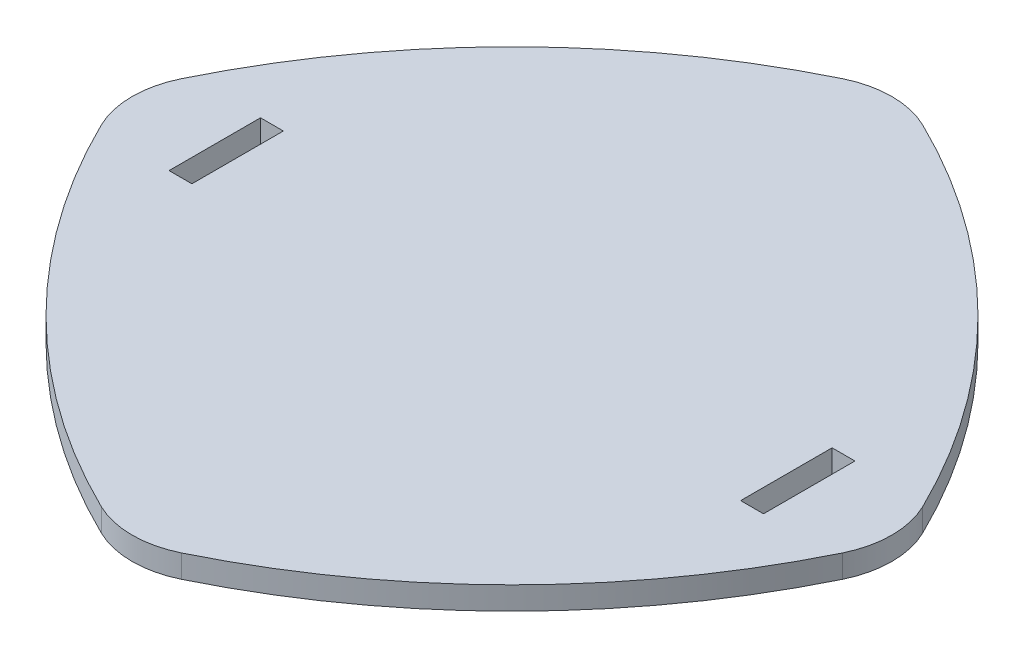
ISO-10303-21;
HEADER;
FILE_DESCRIPTION(('STEP AP214'),'2;1');
FILE_NAME('part.step','',(''),(''),'','','');
FILE_SCHEMA(('AUTOMOTIVE_DESIGN { 1 0 10303 214 1 1 1 1 }'));
ENDSEC;
DATA;
#1=APPLICATION_CONTEXT('core data for automotive mechanical design processes');
#2=APPLICATION_PROTOCOL_DEFINITION('international standard','automotive_design',2000,#1);
#3=PRODUCT_CONTEXT('',#1,'mechanical');
#4=PRODUCT('Part','Part','',(#3));
#5=PRODUCT_RELATED_PRODUCT_CATEGORY('part','',(#4));
#6=PRODUCT_DEFINITION_FORMATION('','',#4);
#7=PRODUCT_DEFINITION_CONTEXT('part definition',#1,'design');
#8=PRODUCT_DEFINITION('design','',#6,#7);
#9=PRODUCT_DEFINITION_SHAPE('','',#8);
#10=(LENGTH_UNIT() NAMED_UNIT(*) SI_UNIT(.MILLI.,.METRE.));
#11=(NAMED_UNIT(*) PLANE_ANGLE_UNIT() SI_UNIT($,.RADIAN.));
#12=(NAMED_UNIT(*) SI_UNIT($,.STERADIAN.) SOLID_ANGLE_UNIT());
#13=UNCERTAINTY_MEASURE_WITH_UNIT(LENGTH_MEASURE(1.E-05),#10,'distance_accuracy_value','');
#14=(GEOMETRIC_REPRESENTATION_CONTEXT(3) GLOBAL_UNCERTAINTY_ASSIGNED_CONTEXT((#13)) GLOBAL_UNIT_ASSIGNED_CONTEXT((#10,
#11,#12)) REPRESENTATION_CONTEXT('',''));
#15=CARTESIAN_POINT('',(0.,0.,0.));
#16=DIRECTION('',(0.,0.,1.));
#17=DIRECTION('',(1.,0.,0.));
#18=AXIS2_PLACEMENT_3D('',#15,#16,#17);
#19=CARTESIAN_POINT('',(6.01040764008565,0.25,-6.01040764008566));
#20=DIRECTION('',(0.,-1.,0.));
#21=DIRECTION('',(0.,0.,-1.));
#22=AXIS2_PLACEMENT_3D('',#19,#20,#21);
#23=CYLINDRICAL_SURFACE('',#22,15.7059520526919);
#24=CARTESIAN_POINT('',(6.01040764008565,0.25,-6.01040764008566));
#25=DIRECTION('',(0.,1.,0.));
#26=DIRECTION('',(0.,0.,-1.));
#27=AXIS2_PLACEMENT_3D('',#24,#25,#26);
#28=CIRCLE('',#27,15.7059520526919);
#29=CARTESIAN_POINT('',(-8.10482693305001,0.25,0.877050731970893));
#30=VERTEX_POINT('',#29);
#31=CARTESIAN_POINT('',(-0.877050731970878,0.25,8.10482693305001));
#32=VERTEX_POINT('',#31);
#33=EDGE_CURVE('E213',#30,#32,#28,.T.);
#34=ORIENTED_EDGE('',*,*,#33,.F.);
#35=DIRECTION('',(0.,-1.,0.));
#36=VECTOR('',#35,1.);
#37=CARTESIAN_POINT('',(-8.10482693305001,0.25,0.877050731970892));
#38=LINE('',#37,#36);
#39=CARTESIAN_POINT('',(-8.10482693305001,-0.25,0.877050731970893));
#40=VERTEX_POINT('',#39);
#41=EDGE_CURVE('E238',#30,#40,#38,.T.);
#42=ORIENTED_EDGE('',*,*,#41,.T.);
#43=CARTESIAN_POINT('',(6.01040764008565,-0.25,-6.01040764008566));
#44=DIRECTION('',(0.,1.,0.));
#45=DIRECTION('',(0.,0.,-1.));
#46=AXIS2_PLACEMENT_3D('',#43,#44,#45);
#47=CIRCLE('',#46,15.7059520526919);
#48=CARTESIAN_POINT('',(-0.877050731970878,-0.25,8.10482693305001));
#49=VERTEX_POINT('',#48);
#50=EDGE_CURVE('E212',#40,#49,#47,.T.);
#51=ORIENTED_EDGE('',*,*,#50,.T.);
#52=DIRECTION('',(0.,-1.,0.));
#53=VECTOR('',#52,1.);
#54=CARTESIAN_POINT('',(-0.877050731970878,0.25,8.10482693305001));
#55=LINE('',#54,#53);
#56=EDGE_CURVE('E226',#49,#32,#55,.F.);
#57=ORIENTED_EDGE('',*,*,#56,.T.);
#58=EDGE_LOOP('',(#34,#42,#51,#57));
#59=FACE_BOUND('',#58,.T.);
#60=ADVANCED_FACE('F34',(#59),#23,.T.);
#61=CARTESIAN_POINT('',(-6.01040764008566,0.25,-6.01040764008565));
#62=DIRECTION('',(0.,-1.,0.));
#63=DIRECTION('',(0.,0.,-1.));
#64=AXIS2_PLACEMENT_3D('',#61,#62,#63);
#65=CYLINDRICAL_SURFACE('',#64,15.7059520526919);
#66=CARTESIAN_POINT('',(-6.01040764008566,-0.25,-6.01040764008565));
#67=DIRECTION('',(0.,1.,0.));
#68=DIRECTION('',(0.,0.,-1.));
#69=AXIS2_PLACEMENT_3D('',#66,#67,#68);
#70=CIRCLE('',#69,15.7059520526919);
#71=CARTESIAN_POINT('',(0.877050731970899,-0.25,8.10482693305001));
#72=VERTEX_POINT('',#71);
#73=CARTESIAN_POINT('',(8.10482693305002,-0.25,0.877050731970885));
#74=VERTEX_POINT('',#73);
#75=EDGE_CURVE('E229',#72,#74,#70,.T.);
#76=ORIENTED_EDGE('',*,*,#75,.T.);
#77=DIRECTION('',(0.,-1.,0.));
#78=VECTOR('',#77,1.);
#79=CARTESIAN_POINT('',(8.10482693305002,0.25,0.877050731970885));
#80=LINE('',#79,#78);
#81=CARTESIAN_POINT('',(8.10482693305002,0.25,0.877050731970885));
#82=VERTEX_POINT('',#81);
#83=EDGE_CURVE('E11',#74,#82,#80,.F.);
#84=ORIENTED_EDGE('',*,*,#83,.T.);
#85=CARTESIAN_POINT('',(-6.01040764008566,0.25,-6.01040764008565));
#86=DIRECTION('',(0.,1.,0.));
#87=DIRECTION('',(0.,0.,-1.));
#88=AXIS2_PLACEMENT_3D('',#85,#86,#87);
#89=CIRCLE('',#88,15.7059520526919);
#90=CARTESIAN_POINT('',(0.877050731970899,0.25,8.10482693305001));
#91=VERTEX_POINT('',#90);
#92=EDGE_CURVE('E216',#91,#82,#89,.T.);
#93=ORIENTED_EDGE('',*,*,#92,.F.);
#94=DIRECTION('',(0.,-1.,0.));
#95=VECTOR('',#94,1.);
#96=CARTESIAN_POINT('',(0.8770507319709,0.25,8.10482693305001));
#97=LINE('',#96,#95);
#98=EDGE_CURVE('E42',#91,#72,#97,.T.);
#99=ORIENTED_EDGE('',*,*,#98,.T.);
#100=EDGE_LOOP('',(#76,#84,#93,#99));
#101=FACE_BOUND('',#100,.T.);
#102=ADVANCED_FACE('F271',(#101),#65,.T.);
#103=CARTESIAN_POINT('',(-6.01040764008565,0.25,6.01040764008566));
#104=DIRECTION('',(0.,-1.,0.));
#105=DIRECTION('',(0.,0.,-1.));
#106=AXIS2_PLACEMENT_3D('',#103,#104,#105);
#107=CYLINDRICAL_SURFACE('',#106,15.7059520526919);
#108=CARTESIAN_POINT('',(-6.01040764008565,-0.25,6.01040764008566));
#109=DIRECTION('',(0.,1.,0.));
#110=DIRECTION('',(0.,0.,-1.));
#111=AXIS2_PLACEMENT_3D('',#108,#109,#110);
#112=CIRCLE('',#111,15.7059520526919);
#113=CARTESIAN_POINT('',(8.10482693305001,-0.25,-0.877050731970892));
#114=VERTEX_POINT('',#113);
#115=CARTESIAN_POINT('',(0.877050731970889,-0.25,-8.10482693305001));
#116=VERTEX_POINT('',#115);
#117=EDGE_CURVE('E232',#114,#116,#112,.T.);
#118=ORIENTED_EDGE('',*,*,#117,.T.);
#119=DIRECTION('',(0.,-1.,0.));
#120=VECTOR('',#119,1.);
#121=CARTESIAN_POINT('',(0.877050731970891,0.25,-8.10482693305001));
#122=LINE('',#121,#120);
#123=CARTESIAN_POINT('',(0.877050731970889,0.25,-8.10482693305001));
#124=VERTEX_POINT('',#123);
#125=EDGE_CURVE('E265',#116,#124,#122,.F.);
#126=ORIENTED_EDGE('',*,*,#125,.T.);
#127=CARTESIAN_POINT('',(-6.01040764008565,0.25,6.01040764008566));
#128=DIRECTION('',(0.,1.,0.));
#129=DIRECTION('',(0.,0.,-1.));
#130=AXIS2_PLACEMENT_3D('',#127,#128,#129);
#131=CIRCLE('',#130,15.7059520526919);
#132=CARTESIAN_POINT('',(8.10482693305001,0.25,-0.877050731970892));
#133=VERTEX_POINT('',#132);
#134=EDGE_CURVE('E220',#133,#124,#131,.T.);
#135=ORIENTED_EDGE('',*,*,#134,.F.);
#136=DIRECTION('',(0.,-1.,0.));
#137=VECTOR('',#136,1.);
#138=CARTESIAN_POINT('',(8.10482693305001,0.25,-0.877050731970891));
#139=LINE('',#138,#137);
#140=EDGE_CURVE('E262',#133,#114,#139,.T.);
#141=ORIENTED_EDGE('',*,*,#140,.T.);
#142=EDGE_LOOP('',(#118,#126,#135,#141));
#143=FACE_BOUND('',#142,.T.);
#144=ADVANCED_FACE('F284',(#143),#107,.T.);
#145=CARTESIAN_POINT('',(6.01040764008566,0.25,6.01040764008565));
#146=DIRECTION('',(0.,-1.,0.));
#147=DIRECTION('',(0.,0.,-1.));
#148=AXIS2_PLACEMENT_3D('',#145,#146,#147);
#149=CYLINDRICAL_SURFACE('',#148,15.7059520526919);
#150=CARTESIAN_POINT('',(6.01040764008566,-0.25,6.01040764008565));
#151=DIRECTION('',(0.,1.,0.));
#152=DIRECTION('',(0.,0.,-1.));
#153=AXIS2_PLACEMENT_3D('',#150,#151,#152);
#154=CIRCLE('',#153,15.7059520526919);
#155=CARTESIAN_POINT('',(-0.877050731970888,-0.25,-8.10482693305001));
#156=VERTEX_POINT('',#155);
#157=CARTESIAN_POINT('',(-8.10482693305001,-0.25,-0.877050731970884));
#158=VERTEX_POINT('',#157);
#159=EDGE_CURVE('E217',#156,#158,#154,.T.);
#160=ORIENTED_EDGE('',*,*,#159,.T.);
#161=DIRECTION('',(0.,-1.,0.));
#162=VECTOR('',#161,1.);
#163=CARTESIAN_POINT('',(-8.10482693305001,0.25,-0.877050731970884));
#164=LINE('',#163,#162);
#165=CARTESIAN_POINT('',(-8.10482693305001,0.25,-0.877050731970884));
#166=VERTEX_POINT('',#165);
#167=EDGE_CURVE('E252',#158,#166,#164,.F.);
#168=ORIENTED_EDGE('',*,*,#167,.T.);
#169=CARTESIAN_POINT('',(6.01040764008566,0.25,6.01040764008565));
#170=DIRECTION('',(0.,1.,0.));
#171=DIRECTION('',(0.,0.,-1.));
#172=AXIS2_PLACEMENT_3D('',#169,#170,#171);
#173=CIRCLE('',#172,15.7059520526919);
#174=CARTESIAN_POINT('',(-0.877050731970888,0.25,-8.10482693305001));
#175=VERTEX_POINT('',#174);
#176=EDGE_CURVE('E223',#175,#166,#173,.T.);
#177=ORIENTED_EDGE('',*,*,#176,.F.);
#178=DIRECTION('',(0.,-1.,0.));
#179=VECTOR('',#178,1.);
#180=CARTESIAN_POINT('',(-0.877050731970888,0.25,-8.10482693305001));
#181=LINE('',#180,#179);
#182=EDGE_CURVE('E249',#175,#156,#181,.T.);
#183=ORIENTED_EDGE('',*,*,#182,.T.);
#184=EDGE_LOOP('',(#160,#168,#177,#183));
#185=FACE_BOUND('',#184,.T.);
#186=ADVANCED_FACE('F295',(#185),#149,.T.);
#187=CARTESIAN_POINT('',(6.01040764008566,0.25,0.));
#188=DIRECTION('',(0.,-1.,0.));
#189=DIRECTION('',(0.,0.,-1.));
#190=AXIS2_PLACEMENT_3D('',#187,#188,#189);
#191=PLANE('',#190);
#192=DIRECTION('',(-1.,0.,0.));
#193=VECTOR('',#192,1.);
#194=CARTESIAN_POINT('',(6.,0.25,-1.));
#195=LINE('',#194,#193);
#196=CARTESIAN_POINT('',(6.5,0.25,-1.));
#197=VERTEX_POINT('',#196);
#198=CARTESIAN_POINT('',(6.,0.25,-1.));
#199=VERTEX_POINT('',#198);
#200=EDGE_CURVE('E165',#197,#199,#195,.T.);
#201=ORIENTED_EDGE('',*,*,#200,.F.);
#202=DIRECTION('',(0.,0.,-1.));
#203=VECTOR('',#202,1.);
#204=CARTESIAN_POINT('',(6.5,0.25,1.));
#205=LINE('',#204,#203);
#206=CARTESIAN_POINT('',(6.5,0.25,1.));
#207=VERTEX_POINT('',#206);
#208=EDGE_CURVE('E49',#207,#197,#205,.T.);
#209=ORIENTED_EDGE('',*,*,#208,.F.);
#210=DIRECTION('',(1.,0.,0.));
#211=VECTOR('',#210,1.);
#212=CARTESIAN_POINT('',(6.,0.25,1.));
#213=LINE('',#212,#211);
#214=CARTESIAN_POINT('',(6.,0.25,1.));
#215=VERTEX_POINT('',#214);
#216=EDGE_CURVE('E158',#215,#207,#213,.T.);
#217=ORIENTED_EDGE('',*,*,#216,.F.);
#218=DIRECTION('',(0.,0.,1.));
#219=VECTOR('',#218,1.);
#220=CARTESIAN_POINT('',(6.,0.25,1.));
#221=LINE('',#220,#219);
#222=EDGE_CURVE('E172',#199,#215,#221,.T.);
#223=ORIENTED_EDGE('',*,*,#222,.F.);
#224=EDGE_LOOP('',(#201,#209,#217,#223));
#225=FACE_BOUND('',#224,.T.);
#226=DIRECTION('',(-1.,0.,0.));
#227=VECTOR('',#226,1.);
#228=CARTESIAN_POINT('',(-6.5,0.25,-1.));
#229=LINE('',#228,#227);
#230=CARTESIAN_POINT('',(-6.,0.25,-1.));
#231=VERTEX_POINT('',#230);
#232=CARTESIAN_POINT('',(-6.5,0.25,-1.));
#233=VERTEX_POINT('',#232);
#234=EDGE_CURVE('E191',#231,#233,#229,.T.);
#235=ORIENTED_EDGE('',*,*,#234,.F.);
#236=DIRECTION('',(0.,0.,-1.));
#237=VECTOR('',#236,1.);
#238=CARTESIAN_POINT('',(-6.,0.25,1.));
#239=LINE('',#238,#237);
#240=CARTESIAN_POINT('',(-6.,0.25,1.));
#241=VERTEX_POINT('',#240);
#242=EDGE_CURVE('E189',#241,#231,#239,.T.);
#243=ORIENTED_EDGE('',*,*,#242,.F.);
#244=DIRECTION('',(1.,0.,0.));
#245=VECTOR('',#244,1.);
#246=CARTESIAN_POINT('',(-6.5,0.25,1.));
#247=LINE('',#246,#245);
#248=CARTESIAN_POINT('',(-6.5,0.25,1.));
#249=VERTEX_POINT('',#248);
#250=EDGE_CURVE('E197',#249,#241,#247,.T.);
#251=ORIENTED_EDGE('',*,*,#250,.F.);
#252=DIRECTION('',(0.,0.,1.));
#253=VECTOR('',#252,1.);
#254=CARTESIAN_POINT('',(-6.5,0.25,1.));
#255=LINE('',#254,#253);
#256=EDGE_CURVE('E194',#233,#249,#255,.T.);
#257=ORIENTED_EDGE('',*,*,#256,.F.);
#258=EDGE_LOOP('',(#235,#243,#251,#257));
#259=FACE_BOUND('',#258,.T.);
#260=ORIENTED_EDGE('',*,*,#176,.T.);
#261=CARTESIAN_POINT('',(-6.30738930866653,0.25,0.));
#262=DIRECTION('',(0.,-1.,0.));
#263=DIRECTION('',(0.,0.,-1.));
#264=AXIS2_PLACEMENT_3D('',#261,#262,#263);
#265=CIRCLE('',#264,2.);
#266=EDGE_CURVE('E260',#166,#30,#265,.F.);
#267=ORIENTED_EDGE('',*,*,#266,.T.);
#268=ORIENTED_EDGE('',*,*,#33,.T.);
#269=CARTESIAN_POINT('',(0.,0.25,6.30738930866653));
#270=DIRECTION('',(0.,-1.,0.));
#271=DIRECTION('',(0.,0.,-1.));
#272=AXIS2_PLACEMENT_3D('',#269,#270,#271);
#273=CIRCLE('',#272,2.);
#274=EDGE_CURVE('E254',#32,#91,#273,.F.);
#275=ORIENTED_EDGE('',*,*,#274,.T.);
#276=ORIENTED_EDGE('',*,*,#92,.T.);
#277=CARTESIAN_POINT('',(6.30738930866653,0.25,0.));
#278=DIRECTION('',(0.,-1.,0.));
#279=DIRECTION('',(0.,0.,-1.));
#280=AXIS2_PLACEMENT_3D('',#277,#278,#279);
#281=CIRCLE('',#280,2.);
#282=EDGE_CURVE('E256',#82,#133,#281,.F.);
#283=ORIENTED_EDGE('',*,*,#282,.T.);
#284=ORIENTED_EDGE('',*,*,#134,.T.);
#285=CARTESIAN_POINT('',(0.,0.25,-6.30738930866653));
#286=DIRECTION('',(0.,-1.,0.));
#287=DIRECTION('',(0.,0.,-1.));
#288=AXIS2_PLACEMENT_3D('',#285,#286,#287);
#289=CIRCLE('',#288,2.);
#290=EDGE_CURVE('E258',#124,#175,#289,.F.);
#291=ORIENTED_EDGE('',*,*,#290,.T.);
#292=EDGE_LOOP('',(#260,#267,#268,#275,#276,#283,#284,#291));
#293=FACE_BOUND('',#292,.T.);
#294=ADVANCED_FACE('F288',(#225,#259,#293),#191,.F.);
#295=CARTESIAN_POINT('',(6.01040764008566,-0.25,0.));
#296=DIRECTION('',(0.,-1.,0.));
#297=DIRECTION('',(0.,0.,-1.));
#298=AXIS2_PLACEMENT_3D('',#295,#296,#297);
#299=PLANE('',#298);
#300=DIRECTION('',(0.,0.,-1.));
#301=VECTOR('',#300,1.);
#302=CARTESIAN_POINT('',(6.5,-0.25,1.));
#303=LINE('',#302,#301);
#304=CARTESIAN_POINT('',(6.5,-0.25,1.));
#305=VERTEX_POINT('',#304);
#306=CARTESIAN_POINT('',(6.5,-0.25,-1.));
#307=VERTEX_POINT('',#306);
#308=EDGE_CURVE('E156',#305,#307,#303,.T.);
#309=ORIENTED_EDGE('',*,*,#308,.T.);
#310=DIRECTION('',(-1.,0.,0.));
#311=VECTOR('',#310,1.);
#312=CARTESIAN_POINT('',(6.,-0.25,-1.));
#313=LINE('',#312,#311);
#314=CARTESIAN_POINT('',(6.,-0.25,-1.));
#315=VERTEX_POINT('',#314);
#316=EDGE_CURVE('E145',#307,#315,#313,.T.);
#317=ORIENTED_EDGE('',*,*,#316,.T.);
#318=DIRECTION('',(0.,0.,1.));
#319=VECTOR('',#318,1.);
#320=CARTESIAN_POINT('',(6.,-0.25,1.));
#321=LINE('',#320,#319);
#322=CARTESIAN_POINT('',(6.,-0.25,1.));
#323=VERTEX_POINT('',#322);
#324=EDGE_CURVE('E167',#315,#323,#321,.T.);
#325=ORIENTED_EDGE('',*,*,#324,.T.);
#326=DIRECTION('',(1.,0.,0.));
#327=VECTOR('',#326,1.);
#328=CARTESIAN_POINT('',(6.,-0.25,1.));
#329=LINE('',#328,#327);
#330=EDGE_CURVE('E163',#323,#305,#329,.T.);
#331=ORIENTED_EDGE('',*,*,#330,.T.);
#332=EDGE_LOOP('',(#309,#317,#325,#331));
#333=FACE_BOUND('',#332,.T.);
#334=DIRECTION('',(0.,0.,-1.));
#335=VECTOR('',#334,1.);
#336=CARTESIAN_POINT('',(-6.,-0.25,1.));
#337=LINE('',#336,#335);
#338=CARTESIAN_POINT('',(-6.,-0.25,1.));
#339=VERTEX_POINT('',#338);
#340=CARTESIAN_POINT('',(-6.,-0.25,-1.));
#341=VERTEX_POINT('',#340);
#342=EDGE_CURVE('E186',#339,#341,#337,.T.);
#343=ORIENTED_EDGE('',*,*,#342,.T.);
#344=DIRECTION('',(-1.,0.,0.));
#345=VECTOR('',#344,1.);
#346=CARTESIAN_POINT('',(-6.5,-0.25,-1.));
#347=LINE('',#346,#345);
#348=CARTESIAN_POINT('',(-6.5,-0.25,-1.));
#349=VERTEX_POINT('',#348);
#350=EDGE_CURVE('E203',#341,#349,#347,.T.);
#351=ORIENTED_EDGE('',*,*,#350,.T.);
#352=DIRECTION('',(0.,0.,1.));
#353=VECTOR('',#352,1.);
#354=CARTESIAN_POINT('',(-6.5,-0.25,1.));
#355=LINE('',#354,#353);
#356=CARTESIAN_POINT('',(-6.5,-0.25,1.));
#357=VERTEX_POINT('',#356);
#358=EDGE_CURVE('E152',#349,#357,#355,.T.);
#359=ORIENTED_EDGE('',*,*,#358,.T.);
#360=DIRECTION('',(1.,0.,0.));
#361=VECTOR('',#360,1.);
#362=CARTESIAN_POINT('',(-6.5,-0.25,1.));
#363=LINE('',#362,#361);
#364=EDGE_CURVE('E183',#357,#339,#363,.T.);
#365=ORIENTED_EDGE('',*,*,#364,.T.);
#366=EDGE_LOOP('',(#343,#351,#359,#365));
#367=FACE_BOUND('',#366,.T.);
#368=ORIENTED_EDGE('',*,*,#50,.F.);
#369=CARTESIAN_POINT('',(-6.30738930866653,-0.25,0.));
#370=DIRECTION('',(0.,-1.,0.));
#371=DIRECTION('',(0.,0.,-1.));
#372=AXIS2_PLACEMENT_3D('',#369,#370,#371);
#373=CIRCLE('',#372,2.);
#374=EDGE_CURVE('E247',#40,#158,#373,.T.);
#375=ORIENTED_EDGE('',*,*,#374,.T.);
#376=ORIENTED_EDGE('',*,*,#159,.F.);
#377=CARTESIAN_POINT('',(0.,-0.25,-6.30738930866653));
#378=DIRECTION('',(0.,-1.,0.));
#379=DIRECTION('',(0.,0.,-1.));
#380=AXIS2_PLACEMENT_3D('',#377,#378,#379);
#381=CIRCLE('',#380,2.);
#382=EDGE_CURVE('E245',#156,#116,#381,.T.);
#383=ORIENTED_EDGE('',*,*,#382,.T.);
#384=ORIENTED_EDGE('',*,*,#117,.F.);
#385=CARTESIAN_POINT('',(6.30738930866653,-0.25,0.));
#386=DIRECTION('',(0.,-1.,0.));
#387=DIRECTION('',(0.,0.,-1.));
#388=AXIS2_PLACEMENT_3D('',#385,#386,#387);
#389=CIRCLE('',#388,2.);
#390=EDGE_CURVE('E243',#114,#74,#389,.T.);
#391=ORIENTED_EDGE('',*,*,#390,.T.);
#392=ORIENTED_EDGE('',*,*,#75,.F.);
#393=CARTESIAN_POINT('',(0.,-0.25,6.30738930866653));
#394=DIRECTION('',(0.,-1.,0.));
#395=DIRECTION('',(0.,0.,-1.));
#396=AXIS2_PLACEMENT_3D('',#393,#394,#395);
#397=CIRCLE('',#396,2.);
#398=EDGE_CURVE('E241',#72,#49,#397,.T.);
#399=ORIENTED_EDGE('',*,*,#398,.T.);
#400=EDGE_LOOP('',(#368,#375,#376,#383,#384,#391,#392,#399));
#401=FACE_BOUND('',#400,.T.);
#402=ADVANCED_FACE('F161',(#333,#367,#401),#299,.T.);
#403=CARTESIAN_POINT('',(-6.30738930866653,0.25,0.));
#404=DIRECTION('',(0.,-1.,0.));
#405=DIRECTION('',(0.,0.,-1.));
#406=AXIS2_PLACEMENT_3D('',#403,#404,#405);
#407=CYLINDRICAL_SURFACE('',#406,2.);
#408=ORIENTED_EDGE('',*,*,#266,.F.);
#409=ORIENTED_EDGE('',*,*,#167,.F.);
#410=ORIENTED_EDGE('',*,*,#374,.F.);
#411=ORIENTED_EDGE('',*,*,#41,.F.);
#412=EDGE_LOOP('',(#408,#409,#410,#411));
#413=FACE_BOUND('',#412,.T.);
#414=ADVANCED_FACE('F300',(#413),#407,.T.);
#415=CARTESIAN_POINT('',(0.,0.25,-6.30738930866653));
#416=DIRECTION('',(0.,-1.,0.));
#417=DIRECTION('',(0.,0.,-1.));
#418=AXIS2_PLACEMENT_3D('',#415,#416,#417);
#419=CYLINDRICAL_SURFACE('',#418,2.);
#420=ORIENTED_EDGE('',*,*,#290,.F.);
#421=ORIENTED_EDGE('',*,*,#125,.F.);
#422=ORIENTED_EDGE('',*,*,#382,.F.);
#423=ORIENTED_EDGE('',*,*,#182,.F.);
#424=EDGE_LOOP('',(#420,#421,#422,#423));
#425=FACE_BOUND('',#424,.T.);
#426=ADVANCED_FACE('F292',(#425),#419,.T.);
#427=CARTESIAN_POINT('',(6.30738930866653,0.25,0.));
#428=DIRECTION('',(0.,-1.,0.));
#429=DIRECTION('',(0.,0.,-1.));
#430=AXIS2_PLACEMENT_3D('',#427,#428,#429);
#431=CYLINDRICAL_SURFACE('',#430,2.);
#432=ORIENTED_EDGE('',*,*,#282,.F.);
#433=ORIENTED_EDGE('',*,*,#83,.F.);
#434=ORIENTED_EDGE('',*,*,#390,.F.);
#435=ORIENTED_EDGE('',*,*,#140,.F.);
#436=EDGE_LOOP('',(#432,#433,#434,#435));
#437=FACE_BOUND('',#436,.T.);
#438=ADVANCED_FACE('F281',(#437),#431,.T.);
#439=CARTESIAN_POINT('',(0.,0.25,6.30738930866653));
#440=DIRECTION('',(0.,-1.,0.));
#441=DIRECTION('',(0.,0.,-1.));
#442=AXIS2_PLACEMENT_3D('',#439,#440,#441);
#443=CYLINDRICAL_SURFACE('',#442,2.);
#444=ORIENTED_EDGE('',*,*,#274,.F.);
#445=ORIENTED_EDGE('',*,*,#56,.F.);
#446=ORIENTED_EDGE('',*,*,#398,.F.);
#447=ORIENTED_EDGE('',*,*,#98,.F.);
#448=EDGE_LOOP('',(#444,#445,#446,#447));
#449=FACE_BOUND('',#448,.T.);
#450=ADVANCED_FACE('F36',(#449),#443,.T.);
#451=CARTESIAN_POINT('',(-6.,-0.251,1.));
#452=DIRECTION('',(1.,0.,0.));
#453=DIRECTION('',(0.,0.,-1.));
#454=AXIS2_PLACEMENT_3D('',#451,#452,#453);
#455=PLANE('',#454);
#456=DIRECTION('',(0.,1.,0.));
#457=VECTOR('',#456,1.);
#458=CARTESIAN_POINT('',(-6.,-0.251,1.));
#459=LINE('',#458,#457);
#460=EDGE_CURVE('E201',#339,#241,#459,.T.);
#461=ORIENTED_EDGE('',*,*,#460,.T.);
#462=ORIENTED_EDGE('',*,*,#242,.T.);
#463=DIRECTION('',(0.,1.,0.));
#464=VECTOR('',#463,1.);
#465=CARTESIAN_POINT('',(-6.,-0.251,-1.));
#466=LINE('',#465,#464);
#467=EDGE_CURVE('E200',#341,#231,#466,.T.);
#468=ORIENTED_EDGE('',*,*,#467,.F.);
#469=ORIENTED_EDGE('',*,*,#342,.F.);
#470=EDGE_LOOP('',(#461,#462,#468,#469));
#471=FACE_BOUND('',#470,.T.);
#472=ADVANCED_FACE('F305',(#471),#455,.F.);
#473=CARTESIAN_POINT('',(-6.5,-0.251,1.));
#474=DIRECTION('',(0.,0.,1.));
#475=DIRECTION('',(1.,0.,0.));
#476=AXIS2_PLACEMENT_3D('',#473,#474,#475);
#477=PLANE('',#476);
#478=DIRECTION('',(0.,1.,0.));
#479=VECTOR('',#478,1.);
#480=CARTESIAN_POINT('',(-6.5,-0.251,1.));
#481=LINE('',#480,#479);
#482=EDGE_CURVE('E204',#357,#249,#481,.T.);
#483=ORIENTED_EDGE('',*,*,#482,.T.);
#484=ORIENTED_EDGE('',*,*,#250,.T.);
#485=ORIENTED_EDGE('',*,*,#460,.F.);
#486=ORIENTED_EDGE('',*,*,#364,.F.);
#487=EDGE_LOOP('',(#483,#484,#485,#486));
#488=FACE_BOUND('',#487,.T.);
#489=ADVANCED_FACE('F310',(#488),#477,.F.);
#490=CARTESIAN_POINT('',(-6.5,-0.251,1.));
#491=DIRECTION('',(-1.,0.,0.));
#492=DIRECTION('',(0.,0.,1.));
#493=AXIS2_PLACEMENT_3D('',#490,#491,#492);
#494=PLANE('',#493);
#495=DIRECTION('',(0.,1.,0.));
#496=VECTOR('',#495,1.);
#497=CARTESIAN_POINT('',(-6.5,-0.251,-1.));
#498=LINE('',#497,#496);
#499=EDGE_CURVE('E206',#349,#233,#498,.T.);
#500=ORIENTED_EDGE('',*,*,#499,.T.);
#501=ORIENTED_EDGE('',*,*,#256,.T.);
#502=ORIENTED_EDGE('',*,*,#482,.F.);
#503=ORIENTED_EDGE('',*,*,#358,.F.);
#504=EDGE_LOOP('',(#500,#501,#502,#503));
#505=FACE_BOUND('',#504,.T.);
#506=ADVANCED_FACE('F371',(#505),#494,.F.);
#507=CARTESIAN_POINT('',(-6.5,-0.251,-1.));
#508=DIRECTION('',(0.,0.,-1.));
#509=DIRECTION('',(-1.,0.,0.));
#510=AXIS2_PLACEMENT_3D('',#507,#508,#509);
#511=PLANE('',#510);
#512=ORIENTED_EDGE('',*,*,#467,.T.);
#513=ORIENTED_EDGE('',*,*,#234,.T.);
#514=ORIENTED_EDGE('',*,*,#499,.F.);
#515=ORIENTED_EDGE('',*,*,#350,.F.);
#516=EDGE_LOOP('',(#512,#513,#514,#515));
#517=FACE_BOUND('',#516,.T.);
#518=ADVANCED_FACE('F381',(#517),#511,.F.);
#519=CARTESIAN_POINT('',(6.5,-0.251,1.));
#520=DIRECTION('',(1.,0.,0.));
#521=DIRECTION('',(0.,0.,-1.));
#522=AXIS2_PLACEMENT_3D('',#519,#520,#521);
#523=PLANE('',#522);
#524=DIRECTION('',(0.,1.,0.));
#525=VECTOR('',#524,1.);
#526=CARTESIAN_POINT('',(6.5,-0.251,1.));
#527=LINE('',#526,#525);
#528=EDGE_CURVE('E153',#305,#207,#527,.T.);
#529=ORIENTED_EDGE('',*,*,#528,.T.);
#530=ORIENTED_EDGE('',*,*,#208,.T.);
#531=DIRECTION('',(0.,1.,0.));
#532=VECTOR('',#531,1.);
#533=CARTESIAN_POINT('',(6.5,-0.251,-1.));
#534=LINE('',#533,#532);
#535=EDGE_CURVE('E147',#307,#197,#534,.T.);
#536=ORIENTED_EDGE('',*,*,#535,.F.);
#537=ORIENTED_EDGE('',*,*,#308,.F.);
#538=EDGE_LOOP('',(#529,#530,#536,#537));
#539=FACE_BOUND('',#538,.T.);
#540=ADVANCED_FACE('F155',(#539),#523,.F.);
#541=CARTESIAN_POINT('',(6.,-0.251,1.));
#542=DIRECTION('',(0.,0.,1.));
#543=DIRECTION('',(1.,0.,0.));
#544=AXIS2_PLACEMENT_3D('',#541,#542,#543);
#545=PLANE('',#544);
#546=DIRECTION('',(0.,1.,0.));
#547=VECTOR('',#546,1.);
#548=CARTESIAN_POINT('',(6.,-0.251,1.));
#549=LINE('',#548,#547);
#550=EDGE_CURVE('E178',#323,#215,#549,.T.);
#551=ORIENTED_EDGE('',*,*,#550,.T.);
#552=ORIENTED_EDGE('',*,*,#216,.T.);
#553=ORIENTED_EDGE('',*,*,#528,.F.);
#554=ORIENTED_EDGE('',*,*,#330,.F.);
#555=EDGE_LOOP('',(#551,#552,#553,#554));
#556=FACE_BOUND('',#555,.T.);
#557=ADVANCED_FACE('F400',(#556),#545,.F.);
#558=CARTESIAN_POINT('',(6.,-0.251,1.));
#559=DIRECTION('',(-1.,0.,0.));
#560=DIRECTION('',(0.,0.,1.));
#561=AXIS2_PLACEMENT_3D('',#558,#559,#560);
#562=PLANE('',#561);
#563=DIRECTION('',(0.,1.,0.));
#564=VECTOR('',#563,1.);
#565=CARTESIAN_POINT('',(6.,-0.251,-1.));
#566=LINE('',#565,#564);
#567=EDGE_CURVE('E57',#315,#199,#566,.T.);
#568=ORIENTED_EDGE('',*,*,#567,.T.);
#569=ORIENTED_EDGE('',*,*,#222,.T.);
#570=ORIENTED_EDGE('',*,*,#550,.F.);
#571=ORIENTED_EDGE('',*,*,#324,.F.);
#572=EDGE_LOOP('',(#568,#569,#570,#571));
#573=FACE_BOUND('',#572,.T.);
#574=ADVANCED_FACE('F409',(#573),#562,.F.);
#575=CARTESIAN_POINT('',(6.,-0.251,-1.));
#576=DIRECTION('',(0.,0.,-1.));
#577=DIRECTION('',(-1.,0.,0.));
#578=AXIS2_PLACEMENT_3D('',#575,#576,#577);
#579=PLANE('',#578);
#580=ORIENTED_EDGE('',*,*,#535,.T.);
#581=ORIENTED_EDGE('',*,*,#200,.T.);
#582=ORIENTED_EDGE('',*,*,#567,.F.);
#583=ORIENTED_EDGE('',*,*,#316,.F.);
#584=EDGE_LOOP('',(#580,#581,#582,#583));
#585=FACE_BOUND('',#584,.T.);
#586=ADVANCED_FACE('F146',(#585),#579,.F.);
#587=CLOSED_SHELL('',(#60,#102,#144,#186,#294,#402,#414,#426,#438,#450,#472,#489,#506,#518,#540,
#557,#574,#586));
#588=MANIFOLD_SOLID_BREP('B2',#587);
#589=ADVANCED_BREP_SHAPE_REPRESENTATION('',(#18,#588),#14);
#590=SHAPE_DEFINITION_REPRESENTATION(#9,#589);
ENDSEC;
END-ISO-10303-21;
